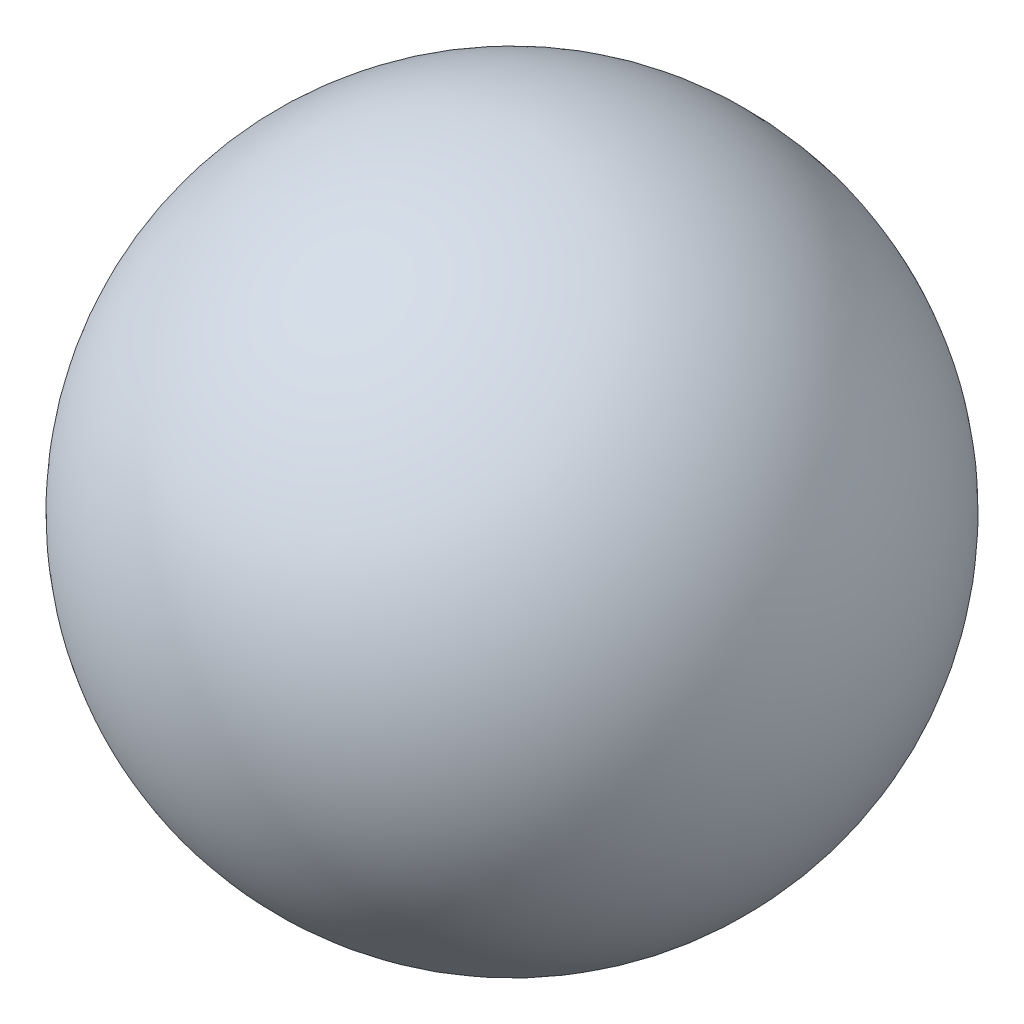
ISO-10303-21;
HEADER;
FILE_DESCRIPTION(('STEP AP214'),'2;1');
FILE_NAME('part.step','',(''),(''),'','','');
FILE_SCHEMA(('AUTOMOTIVE_DESIGN { 1 0 10303 214 1 1 1 1 }'));
ENDSEC;
DATA;
#1=APPLICATION_CONTEXT('core data for automotive mechanical design processes');
#2=APPLICATION_PROTOCOL_DEFINITION('international standard','automotive_design',2000,#1);
#3=PRODUCT_CONTEXT('',#1,'mechanical');
#4=PRODUCT('Part','Part','',(#3));
#5=PRODUCT_RELATED_PRODUCT_CATEGORY('part','',(#4));
#6=PRODUCT_DEFINITION_FORMATION('','',#4);
#7=PRODUCT_DEFINITION_CONTEXT('part definition',#1,'design');
#8=PRODUCT_DEFINITION('design','',#6,#7);
#9=PRODUCT_DEFINITION_SHAPE('','',#8);
#10=(LENGTH_UNIT() NAMED_UNIT(*) SI_UNIT(.MILLI.,.METRE.));
#11=(NAMED_UNIT(*) PLANE_ANGLE_UNIT() SI_UNIT($,.RADIAN.));
#12=(NAMED_UNIT(*) SI_UNIT($,.STERADIAN.) SOLID_ANGLE_UNIT());
#13=UNCERTAINTY_MEASURE_WITH_UNIT(LENGTH_MEASURE(1.E-05),#10,'distance_accuracy_value','');
#14=(GEOMETRIC_REPRESENTATION_CONTEXT(3) GLOBAL_UNCERTAINTY_ASSIGNED_CONTEXT((#13)) GLOBAL_UNIT_ASSIGNED_CONTEXT((#10,
#11,#12)) REPRESENTATION_CONTEXT('',''));
#15=CARTESIAN_POINT('',(0.,0.,0.));
#16=DIRECTION('',(0.,0.,1.));
#17=DIRECTION('',(1.,0.,0.));
#18=AXIS2_PLACEMENT_3D('',#15,#16,#17);
#19=CARTESIAN_POINT('',(67.76,0.605163420473486,-69.3448594596926));
#20=DIRECTION('',(0.,0.00872653549837383,-0.999961923064171));
#21=DIRECTION('',(0.173648177666934,0.984770254550592,0.0085939598157348));
#22=AXIS2_PLACEMENT_3D('',#19,#20,#21);
#23=SPHERICAL_SURFACE('',#22,7.15);
#24=CARTESIAN_POINT('',(67.76,0.667558149286857,-76.4945872096014));
#25=VERTEX_POINT('',#24);
#26=VERTEX_LOOP('',#25);
#27=FACE_BOUND('',#26,.T.);
#28=CARTESIAN_POINT('',(67.76,0.542768691660113,-62.1951317097838));
#29=VERTEX_POINT('',#28);
#30=VERTEX_LOOP('',#29);
#31=FACE_BOUND('',#30,.T.);
#32=ADVANCED_FACE('F16',(#27,#31),#23,.T.);
#33=CLOSED_SHELL('',(#32));
#34=MANIFOLD_SOLID_BREP('B1',#33);
#35=ADVANCED_BREP_SHAPE_REPRESENTATION('',(#18,#34),#14);
#36=SHAPE_DEFINITION_REPRESENTATION(#9,#35);
ENDSEC;
END-ISO-10303-21;
